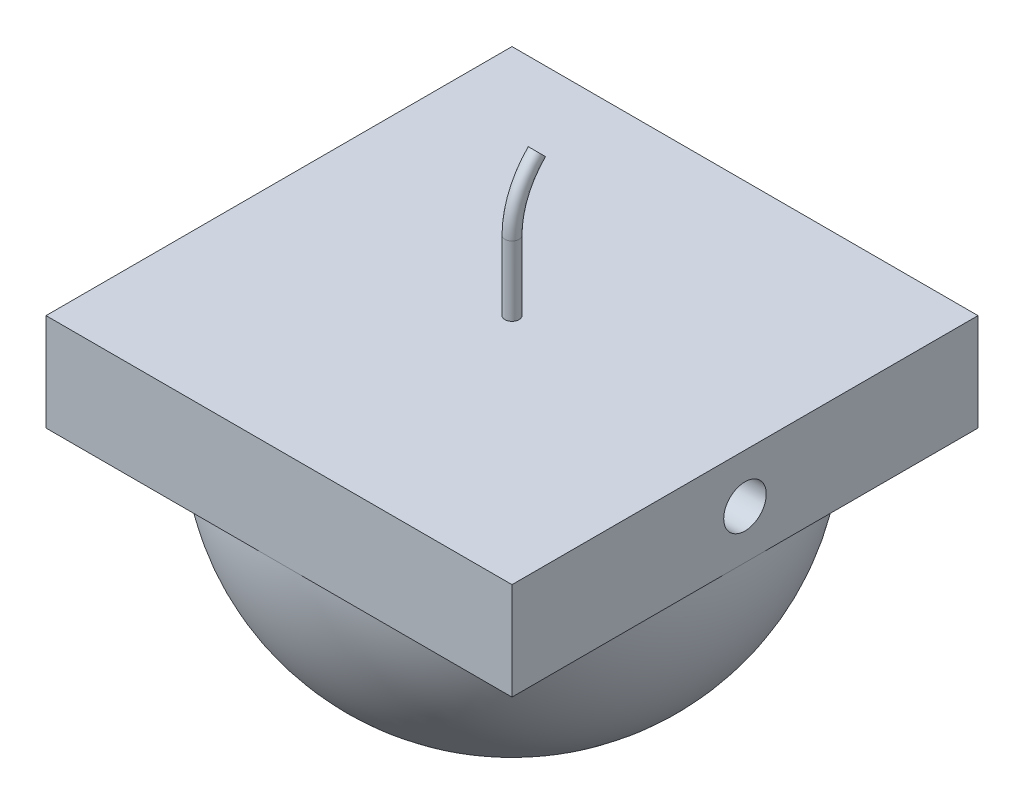
ISO-10303-21;
HEADER;
FILE_DESCRIPTION(('STEP AP214'),'2;1');
FILE_NAME('part.step','',(''),(''),'','','');
FILE_SCHEMA(('AUTOMOTIVE_DESIGN { 1 0 10303 214 1 1 1 1 }'));
ENDSEC;
DATA;
#1=APPLICATION_CONTEXT('core data for automotive mechanical design processes');
#2=APPLICATION_PROTOCOL_DEFINITION('international standard','automotive_design',2000,#1);
#3=PRODUCT_CONTEXT('',#1,'mechanical');
#4=PRODUCT('Part','Part','',(#3));
#5=PRODUCT_RELATED_PRODUCT_CATEGORY('part','',(#4));
#6=PRODUCT_DEFINITION_FORMATION('','',#4);
#7=PRODUCT_DEFINITION_CONTEXT('part definition',#1,'design');
#8=PRODUCT_DEFINITION('design','',#6,#7);
#9=PRODUCT_DEFINITION_SHAPE('','',#8);
#10=(LENGTH_UNIT() NAMED_UNIT(*) SI_UNIT(.MILLI.,.METRE.));
#11=(NAMED_UNIT(*) PLANE_ANGLE_UNIT() SI_UNIT($,.RADIAN.));
#12=(NAMED_UNIT(*) SI_UNIT($,.STERADIAN.) SOLID_ANGLE_UNIT());
#13=UNCERTAINTY_MEASURE_WITH_UNIT(LENGTH_MEASURE(1.E-05),#10,'distance_accuracy_value','');
#14=(GEOMETRIC_REPRESENTATION_CONTEXT(3) GLOBAL_UNCERTAINTY_ASSIGNED_CONTEXT((#13)) GLOBAL_UNIT_ASSIGNED_CONTEXT((#10,
#11,#12)) REPRESENTATION_CONTEXT('',''));
#15=CARTESIAN_POINT('',(0.,0.,0.));
#16=DIRECTION('',(0.,0.,1.));
#17=DIRECTION('',(1.,0.,0.));
#18=AXIS2_PLACEMENT_3D('',#15,#16,#17);
#19=CARTESIAN_POINT('',(0.,0.,0.));
#20=DIRECTION('',(0.,-1.,0.));
#21=DIRECTION('',(0.,0.,-1.));
#22=AXIS2_PLACEMENT_3D('',#19,#20,#21);
#23=PLANE('',#22);
#24=CARTESIAN_POINT('',(-1.11022302462516E-13,0.,0.));
#25=DIRECTION('',(0.,-1.,0.));
#26=DIRECTION('',(0.,0.,-1.));
#27=AXIS2_PLACEMENT_3D('',#24,#25,#26);
#28=CIRCLE('',#27,165.1);
#29=CARTESIAN_POINT('',(-1.1102230246252E-13,8.15214313283364E-13,-165.1));
#30=VERTEX_POINT('',#29);
#31=CARTESIAN_POINT('',(165.1,0.,0.));
#32=VERTEX_POINT('',#31);
#33=EDGE_CURVE('E12',#30,#32,#28,.T.);
#34=ORIENTED_EDGE('',*,*,#33,.F.);
#35=DIRECTION('',(-1.,0.,0.));
#36=VECTOR('',#35,1.);
#37=CARTESIAN_POINT('',(-165.1,0.,-165.1));
#38=LINE('',#37,#36);
#39=CARTESIAN_POINT('',(165.1,0.,-165.1));
#40=VERTEX_POINT('',#39);
#41=EDGE_CURVE('E109',#40,#30,#38,.T.);
#42=ORIENTED_EDGE('',*,*,#41,.F.);
#43=DIRECTION('',(0.,0.,-1.));
#44=VECTOR('',#43,1.);
#45=CARTESIAN_POINT('',(165.1,0.,165.1));
#46=LINE('',#45,#44);
#47=EDGE_CURVE('E127',#32,#40,#46,.T.);
#48=ORIENTED_EDGE('',*,*,#47,.F.);
#49=EDGE_LOOP('',(#34,#42,#48));
#50=FACE_BOUND('',#49,.T.);
#51=ADVANCED_FACE('F53',(#50),#23,.T.);
#52=CARTESIAN_POINT('',(-1.11022302462516E-13,0.,0.));
#53=DIRECTION('',(0.,-1.,0.));
#54=DIRECTION('',(1.,0.,0.));
#55=AXIS2_PLACEMENT_3D('',#52,#53,#54);
#56=CIRCLE('',#55,165.1);
#57=CARTESIAN_POINT('',(-1.11022302462516E-13,0.,165.1));
#58=VERTEX_POINT('',#57);
#59=EDGE_CURVE('E177',#32,#58,#56,.T.);
#60=ORIENTED_EDGE('',*,*,#59,.F.);
#61=CARTESIAN_POINT('',(165.1,0.,165.1));
#62=VERTEX_POINT('',#61);
#63=EDGE_CURVE('E126',#62,#32,#46,.T.);
#64=ORIENTED_EDGE('',*,*,#63,.F.);
#65=DIRECTION('',(1.,0.,0.));
#66=VECTOR('',#65,1.);
#67=CARTESIAN_POINT('',(-165.1,0.,165.1));
#68=LINE('',#67,#66);
#69=EDGE_CURVE('E153',#58,#62,#68,.T.);
#70=ORIENTED_EDGE('',*,*,#69,.F.);
#71=EDGE_LOOP('',(#60,#64,#70));
#72=FACE_BOUND('',#71,.T.);
#73=ADVANCED_FACE('F209',(#72),#23,.T.);
#74=CARTESIAN_POINT('',(-165.1,0.,0.));
#75=VERTEX_POINT('',#74);
#76=EDGE_CURVE('E63',#58,#75,#28,.T.);
#77=ORIENTED_EDGE('',*,*,#76,.F.);
#78=CARTESIAN_POINT('',(-165.1,0.,165.1));
#79=VERTEX_POINT('',#78);
#80=EDGE_CURVE('E148',#79,#58,#68,.T.);
#81=ORIENTED_EDGE('',*,*,#80,.F.);
#82=DIRECTION('',(0.,0.,1.));
#83=VECTOR('',#82,1.);
#84=CARTESIAN_POINT('',(-165.1,0.,165.1));
#85=LINE('',#84,#83);
#86=EDGE_CURVE('E120',#75,#79,#85,.T.);
#87=ORIENTED_EDGE('',*,*,#86,.F.);
#88=EDGE_LOOP('',(#77,#81,#87));
#89=FACE_BOUND('',#88,.T.);
#90=ADVANCED_FACE('F214',(#89),#23,.T.);
#91=CARTESIAN_POINT('',(165.1,69.02,165.1));
#92=DIRECTION('',(-1.,0.,0.));
#93=DIRECTION('',(0.,0.,1.));
#94=AXIS2_PLACEMENT_3D('',#91,#92,#93);
#95=PLANE('',#94);
#96=CARTESIAN_POINT('',(165.1,34.51,0.));
#97=DIRECTION('',(-1.,0.,0.));
#98=DIRECTION('',(0.,0.,1.));
#99=AXIS2_PLACEMENT_3D('',#96,#97,#98);
#100=CIRCLE('',#99,15.0816468418252);
#101=CARTESIAN_POINT('',(165.1,34.51,15.0816468418252));
#102=VERTEX_POINT('',#101);
#103=EDGE_CURVE('E169',#102,#102,#100,.T.);
#104=ORIENTED_EDGE('',*,*,#103,.T.);
#105=EDGE_LOOP('',(#104));
#106=FACE_BOUND('',#105,.T.);
#107=ORIENTED_EDGE('',*,*,#63,.T.);
#108=ORIENTED_EDGE('',*,*,#47,.T.);
#109=DIRECTION('',(0.,-1.,0.));
#110=VECTOR('',#109,1.);
#111=CARTESIAN_POINT('',(165.1,69.02,-165.1));
#112=LINE('',#111,#110);
#113=CARTESIAN_POINT('',(165.1,69.02,-165.1));
#114=VERTEX_POINT('',#113);
#115=EDGE_CURVE('E115',#114,#40,#112,.T.);
#116=ORIENTED_EDGE('',*,*,#115,.F.);
#117=DIRECTION('',(0.,0.,-1.));
#118=VECTOR('',#117,1.);
#119=CARTESIAN_POINT('',(165.1,69.02,165.1));
#120=LINE('',#119,#118);
#121=CARTESIAN_POINT('',(165.1,69.02,165.1));
#122=VERTEX_POINT('',#121);
#123=EDGE_CURVE('E152',#122,#114,#120,.T.);
#124=ORIENTED_EDGE('',*,*,#123,.F.);
#125=DIRECTION('',(0.,-1.,0.));
#126=VECTOR('',#125,1.);
#127=CARTESIAN_POINT('',(165.1,69.02,165.1));
#128=LINE('',#127,#126);
#129=EDGE_CURVE('E143',#122,#62,#128,.T.);
#130=ORIENTED_EDGE('',*,*,#129,.T.);
#131=EDGE_LOOP('',(#107,#108,#116,#124,#130));
#132=FACE_BOUND('',#131,.T.);
#133=ADVANCED_FACE('F55',(#106,#132),#95,.F.);
#134=CARTESIAN_POINT('',(-165.1,69.02,-165.1));
#135=DIRECTION('',(0.,0.,1.));
#136=DIRECTION('',(1.,0.,0.));
#137=AXIS2_PLACEMENT_3D('',#134,#135,#136);
#138=PLANE('',#137);
#139=ORIENTED_EDGE('',*,*,#41,.T.);
#140=CARTESIAN_POINT('',(-165.1,0.,-165.1));
#141=VERTEX_POINT('',#140);
#142=EDGE_CURVE('E112',#30,#141,#38,.T.);
#143=ORIENTED_EDGE('',*,*,#142,.T.);
#144=DIRECTION('',(0.,-1.,0.));
#145=VECTOR('',#144,1.);
#146=CARTESIAN_POINT('',(-165.1,69.02,-165.1));
#147=LINE('',#146,#145);
#148=CARTESIAN_POINT('',(-165.1,69.02,-165.1));
#149=VERTEX_POINT('',#148);
#150=EDGE_CURVE('E135',#149,#141,#147,.T.);
#151=ORIENTED_EDGE('',*,*,#150,.F.);
#152=DIRECTION('',(-1.,0.,0.));
#153=VECTOR('',#152,1.);
#154=CARTESIAN_POINT('',(-165.1,69.02,-165.1));
#155=LINE('',#154,#153);
#156=EDGE_CURVE('E163',#114,#149,#155,.T.);
#157=ORIENTED_EDGE('',*,*,#156,.F.);
#158=ORIENTED_EDGE('',*,*,#115,.T.);
#159=EDGE_LOOP('',(#139,#143,#151,#157,#158));
#160=FACE_BOUND('',#159,.T.);
#161=ADVANCED_FACE('F110',(#160),#138,.F.);
#162=CARTESIAN_POINT('',(-165.1,69.02,165.1));
#163=DIRECTION('',(1.,0.,0.));
#164=DIRECTION('',(0.,0.,-1.));
#165=AXIS2_PLACEMENT_3D('',#162,#163,#164);
#166=PLANE('',#165);
#167=CARTESIAN_POINT('',(-165.1,34.51,0.));
#168=DIRECTION('',(-1.,0.,0.));
#169=DIRECTION('',(0.,0.,1.));
#170=AXIS2_PLACEMENT_3D('',#167,#168,#169);
#171=CIRCLE('',#170,15.0816468418252);
#172=CARTESIAN_POINT('',(-165.1,34.51,15.0816468418252));
#173=VERTEX_POINT('',#172);
#174=EDGE_CURVE('E173',#173,#173,#171,.T.);
#175=ORIENTED_EDGE('',*,*,#174,.F.);
#176=EDGE_LOOP('',(#175));
#177=FACE_BOUND('',#176,.T.);
#178=EDGE_CURVE('E124',#141,#75,#85,.T.);
#179=ORIENTED_EDGE('',*,*,#178,.T.);
#180=ORIENTED_EDGE('',*,*,#86,.T.);
#181=DIRECTION('',(0.,-1.,0.));
#182=VECTOR('',#181,1.);
#183=CARTESIAN_POINT('',(-165.1,69.02,165.1));
#184=LINE('',#183,#182);
#185=CARTESIAN_POINT('',(-165.1,69.02,165.1));
#186=VERTEX_POINT('',#185);
#187=EDGE_CURVE('E137',#186,#79,#184,.T.);
#188=ORIENTED_EDGE('',*,*,#187,.F.);
#189=DIRECTION('',(0.,0.,1.));
#190=VECTOR('',#189,1.);
#191=CARTESIAN_POINT('',(-165.1,69.02,165.1));
#192=LINE('',#191,#190);
#193=EDGE_CURVE('E160',#149,#186,#192,.T.);
#194=ORIENTED_EDGE('',*,*,#193,.F.);
#195=ORIENTED_EDGE('',*,*,#150,.T.);
#196=EDGE_LOOP('',(#179,#180,#188,#194,#195));
#197=FACE_BOUND('',#196,.T.);
#198=ADVANCED_FACE('F236',(#177,#197),#166,.F.);
#199=CARTESIAN_POINT('',(-165.1,69.02,165.1));
#200=DIRECTION('',(0.,0.,-1.));
#201=DIRECTION('',(-1.,0.,0.));
#202=AXIS2_PLACEMENT_3D('',#199,#200,#201);
#203=PLANE('',#202);
#204=ORIENTED_EDGE('',*,*,#80,.T.);
#205=ORIENTED_EDGE('',*,*,#69,.T.);
#206=ORIENTED_EDGE('',*,*,#129,.F.);
#207=DIRECTION('',(1.,0.,0.));
#208=VECTOR('',#207,1.);
#209=CARTESIAN_POINT('',(-165.1,69.02,165.1));
#210=LINE('',#209,#208);
#211=EDGE_CURVE('E147',#186,#122,#210,.T.);
#212=ORIENTED_EDGE('',*,*,#211,.F.);
#213=ORIENTED_EDGE('',*,*,#187,.T.);
#214=EDGE_LOOP('',(#204,#205,#206,#212,#213));
#215=FACE_BOUND('',#214,.T.);
#216=ADVANCED_FACE('F226',(#215),#203,.F.);
#217=CARTESIAN_POINT('',(0.,69.02,0.));
#218=DIRECTION('',(0.,-1.,0.));
#219=DIRECTION('',(0.,0.,-1.));
#220=AXIS2_PLACEMENT_3D('',#217,#218,#219);
#221=PLANE('',#220);
#222=CARTESIAN_POINT('',(0.,69.02,0.));
#223=DIRECTION('',(0.,-1.,0.));
#224=DIRECTION('',(0.,0.,-1.));
#225=AXIS2_PLACEMENT_3D('',#222,#223,#224);
#226=CIRCLE('',#225,5.);
#227=CARTESIAN_POINT('',(0.,69.02,-4.99999999999993));
#228=VERTEX_POINT('',#227);
#229=EDGE_CURVE('E180',#228,#228,#226,.T.);
#230=ORIENTED_EDGE('',*,*,#229,.T.);
#231=EDGE_LOOP('',(#230));
#232=FACE_BOUND('',#231,.T.);
#233=ORIENTED_EDGE('',*,*,#123,.T.);
#234=ORIENTED_EDGE('',*,*,#156,.T.);
#235=ORIENTED_EDGE('',*,*,#193,.T.);
#236=ORIENTED_EDGE('',*,*,#211,.T.);
#237=EDGE_LOOP('',(#233,#234,#235,#236));
#238=FACE_BOUND('',#237,.T.);
#239=ADVANCED_FACE('F219',(#232,#238),#221,.F.);
#240=EDGE_CURVE('E57',#75,#30,#28,.T.);
#241=ORIENTED_EDGE('',*,*,#240,.F.);
#242=ORIENTED_EDGE('',*,*,#178,.F.);
#243=ORIENTED_EDGE('',*,*,#142,.F.);
#244=EDGE_LOOP('',(#241,#242,#243));
#245=FACE_BOUND('',#244,.T.);
#246=ADVANCED_FACE('F122',(#245),#23,.T.);
#247=CARTESIAN_POINT('',(165.1,34.51,0.));
#248=DIRECTION('',(-1.,0.,0.));
#249=DIRECTION('',(0.,0.,1.));
#250=AXIS2_PLACEMENT_3D('',#247,#248,#249);
#251=CYLINDRICAL_SURFACE('',#250,15.0816468418252);
#252=ORIENTED_EDGE('',*,*,#103,.F.);
#253=EDGE_LOOP('',(#252));
#254=FACE_BOUND('',#253,.T.);
#255=ORIENTED_EDGE('',*,*,#174,.T.);
#256=EDGE_LOOP('',(#255));
#257=FACE_BOUND('',#256,.T.);
#258=ADVANCED_FACE('F205',(#254,#257),#251,.F.);
#259=CARTESIAN_POINT('',(-1.11022302462516E-13,0.,0.));
#260=DIRECTION('',(-0.707106781186548,0.,-0.707106781186548));
#261=DIRECTION('',(-0.707106781186548,0.,0.707106781186548));
#262=AXIS2_PLACEMENT_3D('',#259,#260,#261);
#263=SPHERICAL_SURFACE('',#262,165.1);
#264=CARTESIAN_POINT('',(-1.11022302462516E-13,0.,0.));
#265=DIRECTION('',(0.,-1.,0.));
#266=DIRECTION('',(1.,0.,0.));
#267=AXIS2_PLACEMENT_3D('',#264,#265,#266);
#268=SPHERICAL_SURFACE('',#267,165.1);
#269=ORIENTED_EDGE('',*,*,#59,.T.);
#270=ORIENTED_EDGE('',*,*,#76,.T.);
#271=ORIENTED_EDGE('',*,*,#240,.T.);
#272=ORIENTED_EDGE('',*,*,#33,.T.);
#273=EDGE_LOOP('',(#269,#270,#271,#272));
#274=FACE_BOUND('',#273,.T.);
#275=ADVANCED_FACE('F131',(#274),#268,.T.);
#276=CARTESIAN_POINT('',(0.,160.844589296073,-17.6193251740773));
#277=DIRECTION('',(0.,-0.707106781186552,0.707106781186543));
#278=DIRECTION('',(0.,-0.707106781186543,-0.707106781186552));
#279=AXIS2_PLACEMENT_3D('',#276,#277,#278);
#280=PLANE('',#279);
#281=CARTESIAN_POINT('',(0.,160.844589296073,-17.6193251740773));
#282=DIRECTION('',(0.,-0.707106781186552,0.707106781186543));
#283=DIRECTION('',(0.,-0.707106781186543,-0.707106781186552));
#284=AXIS2_PLACEMENT_3D('',#281,#282,#283);
#285=CIRCLE('',#284,5.);
#286=CARTESIAN_POINT('',(0.,164.380123202006,-14.0837912681445));
#287=VERTEX_POINT('',#286);
#288=EDGE_CURVE('E188',#287,#287,#285,.T.);
#289=ORIENTED_EDGE('',*,*,#288,.F.);
#290=EDGE_LOOP('',(#289));
#291=FACE_BOUND('',#290,.T.);
#292=ADVANCED_FACE('F195',(#291),#280,.F.);
#293=CARTESIAN_POINT('',(0.,118.307775500954,-60.1561389691973));
#294=DIRECTION('',(1.,0.,0.));
#295=DIRECTION('',(0.,0.,-1.));
#296=AXIS2_PLACEMENT_3D('',#293,#294,#295);
#297=TOROIDAL_SURFACE('',#296,60.1561389691974,5.);
#298=CARTESIAN_POINT('',(0.,118.307775500954,0.));
#299=DIRECTION('',(0.,-1.,0.));
#300=DIRECTION('',(0.,0.,-1.));
#301=AXIS2_PLACEMENT_3D('',#298,#299,#300);
#302=CIRCLE('',#301,5.);
#303=CARTESIAN_POINT('',(0.,118.307775500954,5.00000000000005));
#304=VERTEX_POINT('',#303);
#305=EDGE_CURVE('E184',#304,#304,#302,.T.);
#306=CARTESIAN_POINT('',(0.,118.307775500954,-60.1561389691973));
#307=DIRECTION('',(1.,0.,0.));
#308=DIRECTION('',(0.,0.,-1.));
#309=AXIS2_PLACEMENT_3D('',#306,#307,#308);
#310=CIRCLE('',#309,65.1561389691974);
#311=EDGE_CURVE('',#287,#304,#310,.T.);
#312=ORIENTED_EDGE('',*,*,#288,.T.);
#313=ORIENTED_EDGE('',*,*,#305,.F.);
#314=ORIENTED_EDGE('',*,*,#311,.T.);
#315=ORIENTED_EDGE('',*,*,#311,.F.);
#316=EDGE_LOOP('',(#312,#314,#313,#315));
#317=FACE_BOUND('',#316,.T.);
#318=ADVANCED_FACE('F193',(#317),#297,.T.);
#319=CARTESIAN_POINT('',(0.,118.307775500954,0.));
#320=DIRECTION('',(0.,-1.,0.));
#321=DIRECTION('',(0.,0.,-1.));
#322=AXIS2_PLACEMENT_3D('',#319,#320,#321);
#323=CYLINDRICAL_SURFACE('',#322,5.);
#324=ORIENTED_EDGE('',*,*,#229,.F.);
#325=EDGE_LOOP('',(#324));
#326=FACE_BOUND('',#325,.T.);
#327=ORIENTED_EDGE('',*,*,#305,.T.);
#328=EDGE_LOOP('',(#327));
#329=FACE_BOUND('',#328,.T.);
#330=ADVANCED_FACE('F202',(#326,#329),#323,.T.);
#331=CLOSED_SHELL('',(#51,#73,#90,#133,#161,#198,#216,#239,#246,#258,#275,#292,#318,#330));
#332=MANIFOLD_SOLID_BREP('B2',#331);
#333=ADVANCED_BREP_SHAPE_REPRESENTATION('',(#18,#332),#14);
#334=SHAPE_DEFINITION_REPRESENTATION(#9,#333);
ENDSEC;
END-ISO-10303-21;
